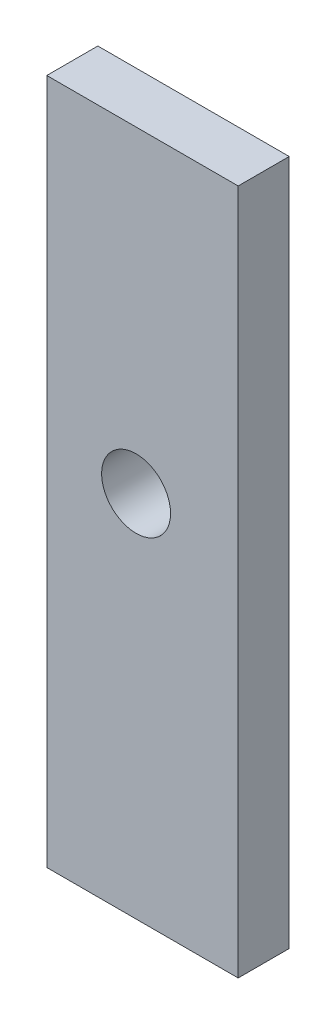
ISO-10303-21;
HEADER;
FILE_DESCRIPTION(('STEP AP214'),'2;1');
FILE_NAME('part.step','',(''),(''),'','','');
FILE_SCHEMA(('AUTOMOTIVE_DESIGN { 1 0 10303 214 1 1 1 1 }'));
ENDSEC;
DATA;
#1=APPLICATION_CONTEXT('core data for automotive mechanical design processes');
#2=APPLICATION_PROTOCOL_DEFINITION('international standard','automotive_design',2000,#1);
#3=PRODUCT_CONTEXT('',#1,'mechanical');
#4=PRODUCT('Part','Part','',(#3));
#5=PRODUCT_RELATED_PRODUCT_CATEGORY('part','',(#4));
#6=PRODUCT_DEFINITION_FORMATION('','',#4);
#7=PRODUCT_DEFINITION_CONTEXT('part definition',#1,'design');
#8=PRODUCT_DEFINITION('design','',#6,#7);
#9=PRODUCT_DEFINITION_SHAPE('','',#8);
#10=(LENGTH_UNIT() NAMED_UNIT(*) SI_UNIT(.MILLI.,.METRE.));
#11=(NAMED_UNIT(*) PLANE_ANGLE_UNIT() SI_UNIT($,.RADIAN.));
#12=(NAMED_UNIT(*) SI_UNIT($,.STERADIAN.) SOLID_ANGLE_UNIT());
#13=UNCERTAINTY_MEASURE_WITH_UNIT(LENGTH_MEASURE(1.E-05),#10,'distance_accuracy_value','');
#14=(GEOMETRIC_REPRESENTATION_CONTEXT(3) GLOBAL_UNCERTAINTY_ASSIGNED_CONTEXT((#13)) GLOBAL_UNIT_ASSIGNED_CONTEXT((#10,
#11,#12)) REPRESENTATION_CONTEXT('',''));
#15=CARTESIAN_POINT('',(0.,0.,0.));
#16=DIRECTION('',(0.,0.,1.));
#17=DIRECTION('',(1.,0.,0.));
#18=AXIS2_PLACEMENT_3D('',#15,#16,#17);
#19=CARTESIAN_POINT('',(0.,0.,2.));
#20=DIRECTION('',(0.,0.,-1.));
#21=DIRECTION('',(-1.,0.,0.));
#22=AXIS2_PLACEMENT_3D('',#19,#20,#21);
#23=PLANE('',#22);
#24=DIRECTION('',(0.,1.,0.));
#25=VECTOR('',#24,1.);
#26=CARTESIAN_POINT('',(4.,-14.441,2.));
#27=LINE('',#26,#25);
#28=CARTESIAN_POINT('',(4.,-14.441,2.));
#29=VERTEX_POINT('',#28);
#30=CARTESIAN_POINT('',(4.,12.44,2.));
#31=VERTEX_POINT('',#30);
#32=EDGE_CURVE('E85',#29,#31,#27,.T.);
#33=ORIENTED_EDGE('',*,*,#32,.T.);
#34=DIRECTION('',(-1.,0.,0.));
#35=VECTOR('',#34,1.);
#36=CARTESIAN_POINT('',(-3.5,12.44,2.));
#37=LINE('',#36,#35);
#38=CARTESIAN_POINT('',(-3.5,12.44,2.));
#39=VERTEX_POINT('',#38);
#40=EDGE_CURVE('E80',#31,#39,#37,.T.);
#41=ORIENTED_EDGE('',*,*,#40,.T.);
#42=DIRECTION('',(0.,-1.,0.));
#43=VECTOR('',#42,1.);
#44=CARTESIAN_POINT('',(-3.5,12.44,2.));
#45=LINE('',#44,#43);
#46=CARTESIAN_POINT('',(-3.5,-14.441,2.));
#47=VERTEX_POINT('',#46);
#48=EDGE_CURVE('E83',#39,#47,#45,.T.);
#49=ORIENTED_EDGE('',*,*,#48,.T.);
#50=DIRECTION('',(1.,0.,0.));
#51=VECTOR('',#50,1.);
#52=CARTESIAN_POINT('',(-3.5,-14.441,2.));
#53=LINE('',#52,#51);
#54=EDGE_CURVE('E50',#47,#29,#53,.T.);
#55=ORIENTED_EDGE('',*,*,#54,.T.);
#56=EDGE_LOOP('',(#33,#41,#49,#55));
#57=FACE_BOUND('',#56,.T.);
#58=CARTESIAN_POINT('',(0.,0.,2.));
#59=DIRECTION('',(0.,0.,1.));
#60=DIRECTION('',(1.,0.,0.));
#61=AXIS2_PLACEMENT_3D('',#58,#59,#60);
#62=CIRCLE('',#61,1.35);
#63=CARTESIAN_POINT('',(1.35,0.,2.));
#64=VERTEX_POINT('',#63);
#65=EDGE_CURVE('E100',#64,#64,#62,.T.);
#66=ORIENTED_EDGE('',*,*,#65,.F.);
#67=EDGE_LOOP('',(#66));
#68=FACE_BOUND('',#67,.T.);
#69=ADVANCED_FACE('F33',(#57,#68),#23,.F.);
#70=CARTESIAN_POINT('',(0.,0.,0.));
#71=DIRECTION('',(0.,0.,-1.));
#72=DIRECTION('',(-1.,0.,0.));
#73=AXIS2_PLACEMENT_3D('',#70,#71,#72);
#74=PLANE('',#73);
#75=DIRECTION('',(0.,1.,0.));
#76=VECTOR('',#75,1.);
#77=CARTESIAN_POINT('',(4.,-14.441,0.));
#78=LINE('',#77,#76);
#79=CARTESIAN_POINT('',(4.,-14.441,0.));
#80=VERTEX_POINT('',#79);
#81=CARTESIAN_POINT('',(4.,12.44,0.));
#82=VERTEX_POINT('',#81);
#83=EDGE_CURVE('E97',#80,#82,#78,.T.);
#84=ORIENTED_EDGE('',*,*,#83,.F.);
#85=DIRECTION('',(1.,0.,0.));
#86=VECTOR('',#85,1.);
#87=CARTESIAN_POINT('',(-3.5,-14.441,0.));
#88=LINE('',#87,#86);
#89=CARTESIAN_POINT('',(-3.5,-14.441,0.));
#90=VERTEX_POINT('',#89);
#91=EDGE_CURVE('E73',#90,#80,#88,.T.);
#92=ORIENTED_EDGE('',*,*,#91,.F.);
#93=DIRECTION('',(0.,-1.,0.));
#94=VECTOR('',#93,1.);
#95=CARTESIAN_POINT('',(-3.5,12.44,0.));
#96=LINE('',#95,#94);
#97=CARTESIAN_POINT('',(-3.5,12.44,0.));
#98=VERTEX_POINT('',#97);
#99=EDGE_CURVE('E67',#98,#90,#96,.T.);
#100=ORIENTED_EDGE('',*,*,#99,.F.);
#101=DIRECTION('',(-1.,0.,0.));
#102=VECTOR('',#101,1.);
#103=CARTESIAN_POINT('',(-3.5,12.44,0.));
#104=LINE('',#103,#102);
#105=EDGE_CURVE('E89',#82,#98,#104,.T.);
#106=ORIENTED_EDGE('',*,*,#105,.F.);
#107=EDGE_LOOP('',(#84,#92,#100,#106));
#108=FACE_BOUND('',#107,.T.);
#109=CARTESIAN_POINT('',(0.,0.,0.));
#110=DIRECTION('',(0.,0.,1.));
#111=DIRECTION('',(1.,0.,0.));
#112=AXIS2_PLACEMENT_3D('',#109,#110,#111);
#113=CIRCLE('',#112,1.35);
#114=CARTESIAN_POINT('',(1.35,0.,0.));
#115=VERTEX_POINT('',#114);
#116=EDGE_CURVE('E112',#115,#115,#113,.T.);
#117=ORIENTED_EDGE('',*,*,#116,.T.);
#118=EDGE_LOOP('',(#117));
#119=FACE_BOUND('',#118,.T.);
#120=ADVANCED_FACE('F108',(#108,#119),#74,.T.);
#121=CARTESIAN_POINT('',(4.,-14.441,2.));
#122=DIRECTION('',(-1.,0.,0.));
#123=DIRECTION('',(0.,-1.,0.));
#124=AXIS2_PLACEMENT_3D('',#121,#122,#123);
#125=PLANE('',#124);
#126=ORIENTED_EDGE('',*,*,#83,.T.);
#127=DIRECTION('',(0.,0.,-1.));
#128=VECTOR('',#127,1.);
#129=CARTESIAN_POINT('',(4.,12.44,2.));
#130=LINE('',#129,#128);
#131=EDGE_CURVE('E11',#31,#82,#130,.T.);
#132=ORIENTED_EDGE('',*,*,#131,.F.);
#133=ORIENTED_EDGE('',*,*,#32,.F.);
#134=DIRECTION('',(0.,0.,-1.));
#135=VECTOR('',#134,1.);
#136=CARTESIAN_POINT('',(4.,-14.441,2.));
#137=LINE('',#136,#135);
#138=EDGE_CURVE('E93',#29,#80,#137,.T.);
#139=ORIENTED_EDGE('',*,*,#138,.T.);
#140=EDGE_LOOP('',(#126,#132,#133,#139));
#141=FACE_BOUND('',#140,.T.);
#142=ADVANCED_FACE('F35',(#141),#125,.F.);
#143=CARTESIAN_POINT('',(-3.5,12.44,2.));
#144=DIRECTION('',(0.,-1.,0.));
#145=DIRECTION('',(0.,0.,-1.));
#146=AXIS2_PLACEMENT_3D('',#143,#144,#145);
#147=PLANE('',#146);
#148=ORIENTED_EDGE('',*,*,#105,.T.);
#149=DIRECTION('',(0.,0.,-1.));
#150=VECTOR('',#149,1.);
#151=CARTESIAN_POINT('',(-3.5,12.44,2.));
#152=LINE('',#151,#150);
#153=EDGE_CURVE('E42',#39,#98,#152,.T.);
#154=ORIENTED_EDGE('',*,*,#153,.F.);
#155=ORIENTED_EDGE('',*,*,#40,.F.);
#156=ORIENTED_EDGE('',*,*,#131,.T.);
#157=EDGE_LOOP('',(#148,#154,#155,#156));
#158=FACE_BOUND('',#157,.T.);
#159=ADVANCED_FACE('F88',(#158),#147,.F.);
#160=CARTESIAN_POINT('',(-3.5,12.44,2.));
#161=DIRECTION('',(1.,0.,0.));
#162=DIRECTION('',(0.,1.,0.));
#163=AXIS2_PLACEMENT_3D('',#160,#161,#162);
#164=PLANE('',#163);
#165=ORIENTED_EDGE('',*,*,#99,.T.);
#166=DIRECTION('',(0.,0.,-1.));
#167=VECTOR('',#166,1.);
#168=CARTESIAN_POINT('',(-3.5,-14.441,2.));
#169=LINE('',#168,#167);
#170=EDGE_CURVE('E90',#47,#90,#169,.T.);
#171=ORIENTED_EDGE('',*,*,#170,.F.);
#172=ORIENTED_EDGE('',*,*,#48,.F.);
#173=ORIENTED_EDGE('',*,*,#153,.T.);
#174=EDGE_LOOP('',(#165,#171,#172,#173));
#175=FACE_BOUND('',#174,.T.);
#176=ADVANCED_FACE('F91',(#175),#164,.F.);
#177=CARTESIAN_POINT('',(-3.5,-14.441,2.));
#178=DIRECTION('',(0.,1.,0.));
#179=DIRECTION('',(0.,0.,1.));
#180=AXIS2_PLACEMENT_3D('',#177,#178,#179);
#181=PLANE('',#180);
#182=ORIENTED_EDGE('',*,*,#91,.T.);
#183=ORIENTED_EDGE('',*,*,#138,.F.);
#184=ORIENTED_EDGE('',*,*,#54,.F.);
#185=ORIENTED_EDGE('',*,*,#170,.T.);
#186=EDGE_LOOP('',(#182,#183,#184,#185));
#187=FACE_BOUND('',#186,.T.);
#188=ADVANCED_FACE('F105',(#187),#181,.F.);
#189=CARTESIAN_POINT('',(0.,0.,2.));
#190=DIRECTION('',(0.,0.,-1.));
#191=DIRECTION('',(-1.,0.,0.));
#192=AXIS2_PLACEMENT_3D('',#189,#190,#191);
#193=CYLINDRICAL_SURFACE('',#192,1.35);
#194=ORIENTED_EDGE('',*,*,#65,.T.);
#195=EDGE_LOOP('',(#194));
#196=FACE_BOUND('',#195,.T.);
#197=ORIENTED_EDGE('',*,*,#116,.F.);
#198=EDGE_LOOP('',(#197));
#199=FACE_BOUND('',#198,.T.);
#200=ADVANCED_FACE('F118',(#196,#199),#193,.F.);
#201=CLOSED_SHELL('',(#69,#120,#142,#159,#176,#188,#200));
#202=MANIFOLD_SOLID_BREP('B2',#201);
#203=ADVANCED_BREP_SHAPE_REPRESENTATION('',(#18,#202),#14);
#204=SHAPE_DEFINITION_REPRESENTATION(#9,#203);
ENDSEC;
END-ISO-10303-21;
